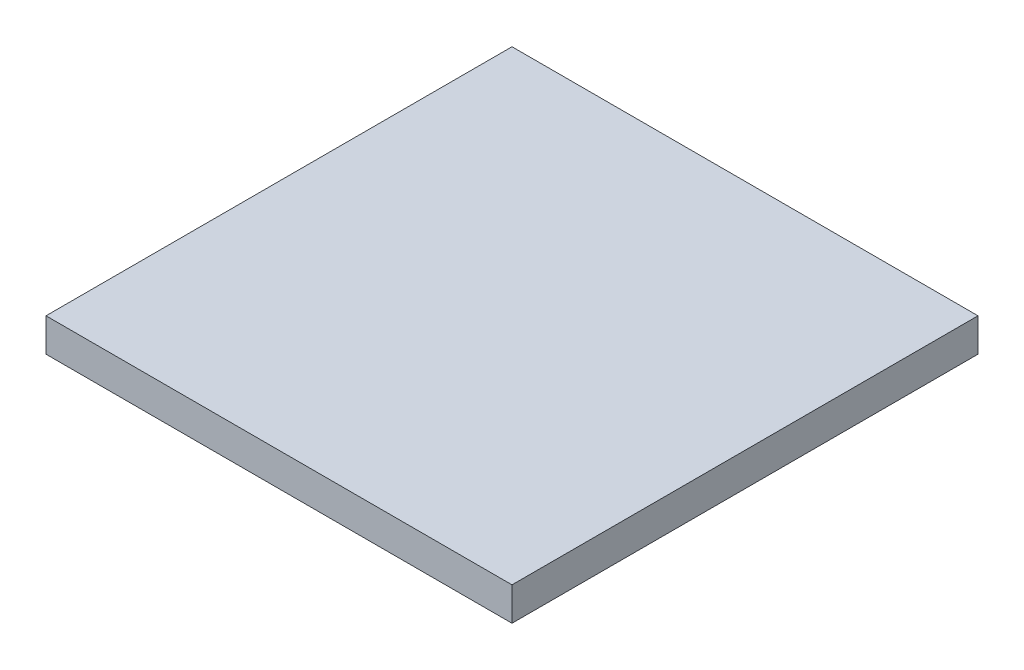
ISO-10303-21;
HEADER;
FILE_DESCRIPTION(('STEP AP214'),'2;1');
FILE_NAME('part.step','',(''),(''),'','','');
FILE_SCHEMA(('AUTOMOTIVE_DESIGN { 1 0 10303 214 1 1 1 1 }'));
ENDSEC;
DATA;
#1=APPLICATION_CONTEXT('core data for automotive mechanical design processes');
#2=APPLICATION_PROTOCOL_DEFINITION('international standard','automotive_design',2000,#1);
#3=PRODUCT_CONTEXT('',#1,'mechanical');
#4=PRODUCT('Part','Part','',(#3));
#5=PRODUCT_RELATED_PRODUCT_CATEGORY('part','',(#4));
#6=PRODUCT_DEFINITION_FORMATION('','',#4);
#7=PRODUCT_DEFINITION_CONTEXT('part definition',#1,'design');
#8=PRODUCT_DEFINITION('design','',#6,#7);
#9=PRODUCT_DEFINITION_SHAPE('','',#8);
#10=(LENGTH_UNIT() NAMED_UNIT(*) SI_UNIT(.MILLI.,.METRE.));
#11=(NAMED_UNIT(*) PLANE_ANGLE_UNIT() SI_UNIT($,.RADIAN.));
#12=(NAMED_UNIT(*) SI_UNIT($,.STERADIAN.) SOLID_ANGLE_UNIT());
#13=UNCERTAINTY_MEASURE_WITH_UNIT(LENGTH_MEASURE(1.E-05),#10,'distance_accuracy_value','');
#14=(GEOMETRIC_REPRESENTATION_CONTEXT(3) GLOBAL_UNCERTAINTY_ASSIGNED_CONTEXT((#13)) GLOBAL_UNIT_ASSIGNED_CONTEXT((#10,
#11,#12)) REPRESENTATION_CONTEXT('',''));
#15=CARTESIAN_POINT('',(0.,0.,0.));
#16=DIRECTION('',(0.,0.,1.));
#17=DIRECTION('',(1.,0.,0.));
#18=AXIS2_PLACEMENT_3D('',#15,#16,#17);
#19=CARTESIAN_POINT('',(0.,0.,0.));
#20=DIRECTION('',(0.,1.,0.));
#21=DIRECTION('',(0.,0.,1.));
#22=AXIS2_PLACEMENT_3D('',#19,#20,#21);
#23=PLANE('',#22);
#24=DIRECTION('',(0.,0.,-1.));
#25=VECTOR('',#24,1.);
#26=CARTESIAN_POINT('',(7.,0.,7.));
#27=LINE('',#26,#25);
#28=CARTESIAN_POINT('',(7.,0.,7.));
#29=VERTEX_POINT('',#28);
#30=CARTESIAN_POINT('',(7.,0.,-7.));
#31=VERTEX_POINT('',#30);
#32=EDGE_CURVE('E56',#29,#31,#27,.T.);
#33=ORIENTED_EDGE('',*,*,#32,.F.);
#34=DIRECTION('',(1.,0.,0.));
#35=VECTOR('',#34,1.);
#36=CARTESIAN_POINT('',(-7.,0.,7.));
#37=LINE('',#36,#35);
#38=CARTESIAN_POINT('',(-7.,0.,7.));
#39=VERTEX_POINT('',#38);
#40=EDGE_CURVE('E19',#39,#29,#37,.T.);
#41=ORIENTED_EDGE('',*,*,#40,.F.);
#42=DIRECTION('',(0.,0.,1.));
#43=VECTOR('',#42,1.);
#44=CARTESIAN_POINT('',(-7.,0.,-7.));
#45=LINE('',#44,#43);
#46=CARTESIAN_POINT('',(-7.,0.,-7.));
#47=VERTEX_POINT('',#46);
#48=EDGE_CURVE('E78',#47,#39,#45,.T.);
#49=ORIENTED_EDGE('',*,*,#48,.F.);
#50=DIRECTION('',(-1.,0.,0.));
#51=VECTOR('',#50,1.);
#52=CARTESIAN_POINT('',(7.,0.,-7.));
#53=LINE('',#52,#51);
#54=EDGE_CURVE('E54',#31,#47,#53,.T.);
#55=ORIENTED_EDGE('',*,*,#54,.F.);
#56=EDGE_LOOP('',(#33,#41,#49,#55));
#57=FACE_BOUND('',#56,.T.);
#58=ADVANCED_FACE('F16',(#57),#23,.F.);
#59=CARTESIAN_POINT('',(-7.,0.,7.));
#60=DIRECTION('',(0.,0.,1.));
#61=DIRECTION('',(1.,0.,0.));
#62=AXIS2_PLACEMENT_3D('',#59,#60,#61);
#63=PLANE('',#62);
#64=DIRECTION('',(1.,0.,0.));
#65=VECTOR('',#64,1.);
#66=CARTESIAN_POINT('',(0.,1.,7.));
#67=LINE('',#66,#65);
#68=CARTESIAN_POINT('',(-7.,1.,7.));
#69=VERTEX_POINT('',#68);
#70=CARTESIAN_POINT('',(7.,1.,7.));
#71=VERTEX_POINT('',#70);
#72=EDGE_CURVE('E82',#69,#71,#67,.T.);
#73=ORIENTED_EDGE('',*,*,#72,.F.);
#74=DIRECTION('',(0.,1.,0.));
#75=VECTOR('',#74,1.);
#76=CARTESIAN_POINT('',(-7.,0.,7.));
#77=LINE('',#76,#75);
#78=EDGE_CURVE('E67',#39,#69,#77,.T.);
#79=ORIENTED_EDGE('',*,*,#78,.F.);
#80=ORIENTED_EDGE('',*,*,#40,.T.);
#81=DIRECTION('',(0.,1.,0.));
#82=VECTOR('',#81,1.);
#83=CARTESIAN_POINT('',(7.,0.,7.));
#84=LINE('',#83,#82);
#85=EDGE_CURVE('E62',#71,#29,#84,.F.);
#86=ORIENTED_EDGE('',*,*,#85,.F.);
#87=EDGE_LOOP('',(#73,#79,#80,#86));
#88=FACE_BOUND('',#87,.T.);
#89=ADVANCED_FACE('F64',(#88),#63,.T.);
#90=CARTESIAN_POINT('',(7.,0.,7.));
#91=DIRECTION('',(1.,0.,0.));
#92=DIRECTION('',(0.,0.,-1.));
#93=AXIS2_PLACEMENT_3D('',#90,#91,#92);
#94=PLANE('',#93);
#95=DIRECTION('',(0.,0.,1.));
#96=VECTOR('',#95,1.);
#97=CARTESIAN_POINT('',(7.,1.,0.));
#98=LINE('',#97,#96);
#99=CARTESIAN_POINT('',(7.,1.,-7.));
#100=VERTEX_POINT('',#99);
#101=EDGE_CURVE('E71',#71,#100,#98,.F.);
#102=ORIENTED_EDGE('',*,*,#101,.F.);
#103=ORIENTED_EDGE('',*,*,#85,.T.);
#104=ORIENTED_EDGE('',*,*,#32,.T.);
#105=DIRECTION('',(0.,1.,0.));
#106=VECTOR('',#105,1.);
#107=CARTESIAN_POINT('',(7.,0.,-7.));
#108=LINE('',#107,#106);
#109=EDGE_CURVE('E74',#100,#31,#108,.F.);
#110=ORIENTED_EDGE('',*,*,#109,.F.);
#111=EDGE_LOOP('',(#102,#103,#104,#110));
#112=FACE_BOUND('',#111,.T.);
#113=ADVANCED_FACE('F69',(#112),#94,.T.);
#114=CARTESIAN_POINT('',(7.,0.,-7.));
#115=DIRECTION('',(0.,0.,-1.));
#116=DIRECTION('',(-1.,0.,0.));
#117=AXIS2_PLACEMENT_3D('',#114,#115,#116);
#118=PLANE('',#117);
#119=DIRECTION('',(1.,0.,0.));
#120=VECTOR('',#119,1.);
#121=CARTESIAN_POINT('',(0.,1.,-7.));
#122=LINE('',#121,#120);
#123=CARTESIAN_POINT('',(-7.,1.,-7.));
#124=VERTEX_POINT('',#123);
#125=EDGE_CURVE('E25',#100,#124,#122,.F.);
#126=ORIENTED_EDGE('',*,*,#125,.F.);
#127=ORIENTED_EDGE('',*,*,#109,.T.);
#128=ORIENTED_EDGE('',*,*,#54,.T.);
#129=DIRECTION('',(0.,1.,0.));
#130=VECTOR('',#129,1.);
#131=CARTESIAN_POINT('',(-7.,0.,-7.));
#132=LINE('',#131,#130);
#133=EDGE_CURVE('E34',#124,#47,#132,.F.);
#134=ORIENTED_EDGE('',*,*,#133,.F.);
#135=EDGE_LOOP('',(#126,#127,#128,#134));
#136=FACE_BOUND('',#135,.T.);
#137=ADVANCED_FACE('F88',(#136),#118,.T.);
#138=CARTESIAN_POINT('',(-7.,0.,-7.));
#139=DIRECTION('',(-1.,0.,0.));
#140=DIRECTION('',(0.,0.,1.));
#141=AXIS2_PLACEMENT_3D('',#138,#139,#140);
#142=PLANE('',#141);
#143=DIRECTION('',(0.,0.,1.));
#144=VECTOR('',#143,1.);
#145=CARTESIAN_POINT('',(-7.,1.,0.));
#146=LINE('',#145,#144);
#147=EDGE_CURVE('E11',#124,#69,#146,.T.);
#148=ORIENTED_EDGE('',*,*,#147,.F.);
#149=ORIENTED_EDGE('',*,*,#133,.T.);
#150=ORIENTED_EDGE('',*,*,#48,.T.);
#151=ORIENTED_EDGE('',*,*,#78,.T.);
#152=EDGE_LOOP('',(#148,#149,#150,#151));
#153=FACE_BOUND('',#152,.T.);
#154=ADVANCED_FACE('F90',(#153),#142,.T.);
#155=CARTESIAN_POINT('',(0.,1.,0.));
#156=DIRECTION('',(0.,1.,0.));
#157=DIRECTION('',(0.,0.,1.));
#158=AXIS2_PLACEMENT_3D('',#155,#156,#157);
#159=PLANE('',#158);
#160=ORIENTED_EDGE('',*,*,#125,.T.);
#161=ORIENTED_EDGE('',*,*,#147,.T.);
#162=ORIENTED_EDGE('',*,*,#72,.T.);
#163=ORIENTED_EDGE('',*,*,#101,.T.);
#164=EDGE_LOOP('',(#160,#161,#162,#163));
#165=FACE_BOUND('',#164,.T.);
#166=ADVANCED_FACE('F87',(#165),#159,.T.);
#167=CLOSED_SHELL('',(#58,#89,#113,#137,#154,#166));
#168=MANIFOLD_SOLID_BREP('B1',#167);
#169=ADVANCED_BREP_SHAPE_REPRESENTATION('',(#18,#168),#14);
#170=SHAPE_DEFINITION_REPRESENTATION(#9,#169);
ENDSEC;
END-ISO-10303-21;
